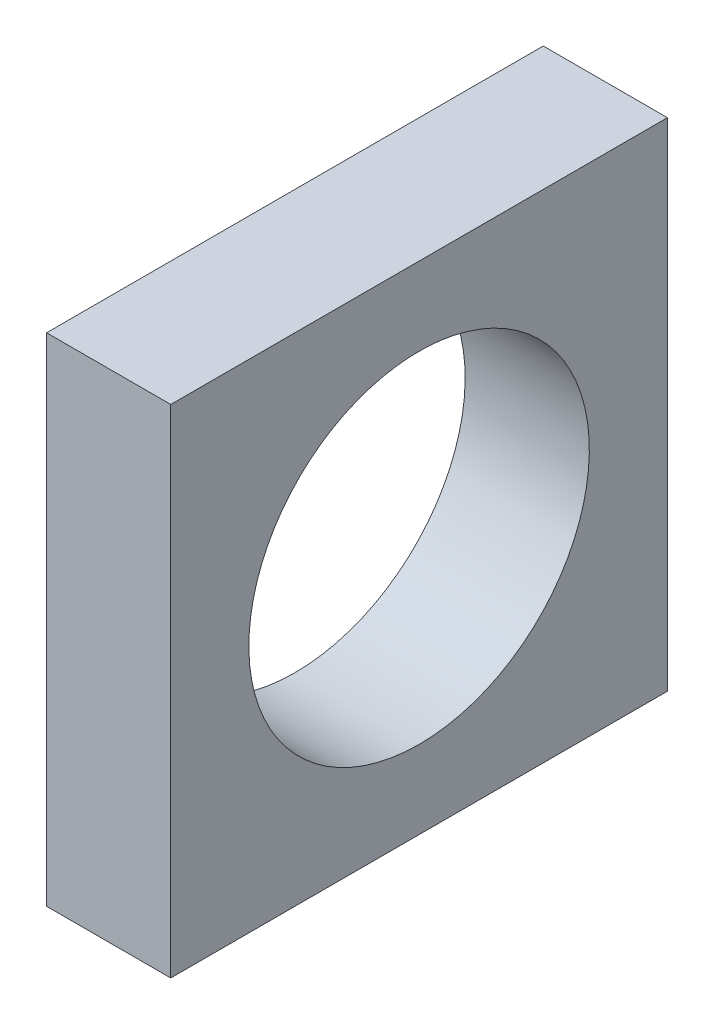
ISO-10303-21;
HEADER;
FILE_DESCRIPTION(('STEP AP214'),'2;1');
FILE_NAME('part.step','',(''),(''),'','','');
FILE_SCHEMA(('AUTOMOTIVE_DESIGN { 1 0 10303 214 1 1 1 1 }'));
ENDSEC;
DATA;
#1=APPLICATION_CONTEXT('core data for automotive mechanical design processes');
#2=APPLICATION_PROTOCOL_DEFINITION('international standard','automotive_design',2000,#1);
#3=PRODUCT_CONTEXT('',#1,'mechanical');
#4=PRODUCT('Part','Part','',(#3));
#5=PRODUCT_RELATED_PRODUCT_CATEGORY('part','',(#4));
#6=PRODUCT_DEFINITION_FORMATION('','',#4);
#7=PRODUCT_DEFINITION_CONTEXT('part definition',#1,'design');
#8=PRODUCT_DEFINITION('design','',#6,#7);
#9=PRODUCT_DEFINITION_SHAPE('','',#8);
#10=(LENGTH_UNIT() NAMED_UNIT(*) SI_UNIT(.MILLI.,.METRE.));
#11=(NAMED_UNIT(*) PLANE_ANGLE_UNIT() SI_UNIT($,.RADIAN.));
#12=(NAMED_UNIT(*) SI_UNIT($,.STERADIAN.) SOLID_ANGLE_UNIT());
#13=UNCERTAINTY_MEASURE_WITH_UNIT(LENGTH_MEASURE(1.E-05),#10,'distance_accuracy_value','');
#14=(GEOMETRIC_REPRESENTATION_CONTEXT(3) GLOBAL_UNCERTAINTY_ASSIGNED_CONTEXT((#13)) GLOBAL_UNIT_ASSIGNED_CONTEXT((#10,
#11,#12)) REPRESENTATION_CONTEXT('',''));
#15=CARTESIAN_POINT('',(0.,0.,0.));
#16=DIRECTION('',(0.,0.,1.));
#17=DIRECTION('',(1.,0.,0.));
#18=AXIS2_PLACEMENT_3D('',#15,#16,#17);
#19=CARTESIAN_POINT('',(5.14767421570164,-28.7493896494891,25.4));
#20=DIRECTION('',(1.,0.,0.));
#21=DIRECTION('',(0.,0.,-1.));
#22=AXIS2_PLACEMENT_3D('',#19,#20,#21);
#23=PLANE('',#22);
#24=CARTESIAN_POINT('',(5.14767421570164,-16.0493896494891,12.7));
#25=DIRECTION('',(-1.,0.,0.));
#26=DIRECTION('',(0.,-1.,0.));
#27=AXIS2_PLACEMENT_3D('',#24,#25,#26);
#28=CIRCLE('',#27,8.70585);
#29=CARTESIAN_POINT('',(5.14767421570164,-24.7552396494891,12.7));
#30=VERTEX_POINT('',#29);
#31=EDGE_CURVE('E112',#30,#30,#28,.T.);
#32=ORIENTED_EDGE('',*,*,#31,.F.);
#33=EDGE_LOOP('',(#32));
#34=FACE_BOUND('',#33,.T.);
#35=DIRECTION('',(0.,-1.,0.));
#36=VECTOR('',#35,1.);
#37=CARTESIAN_POINT('',(5.14767421570164,-28.7493896494891,0.));
#38=LINE('',#37,#36);
#39=CARTESIAN_POINT('',(5.14767421570164,-3.34938964948908,0.));
#40=VERTEX_POINT('',#39);
#41=CARTESIAN_POINT('',(5.14767421570164,-28.7493896494891,0.));
#42=VERTEX_POINT('',#41);
#43=EDGE_CURVE('E96',#40,#42,#38,.T.);
#44=ORIENTED_EDGE('',*,*,#43,.T.);
#45=DIRECTION('',(0.,0.,-1.));
#46=VECTOR('',#45,1.);
#47=CARTESIAN_POINT('',(5.14767421570164,-28.7493896494891,25.4));
#48=LINE('',#47,#46);
#49=CARTESIAN_POINT('',(5.14767421570164,-28.7493896494891,25.4));
#50=VERTEX_POINT('',#49);
#51=EDGE_CURVE('E11',#50,#42,#48,.T.);
#52=ORIENTED_EDGE('',*,*,#51,.F.);
#53=DIRECTION('',(0.,-1.,0.));
#54=VECTOR('',#53,1.);
#55=CARTESIAN_POINT('',(5.14767421570164,-28.7493896494891,25.4));
#56=LINE('',#55,#54);
#57=CARTESIAN_POINT('',(5.14767421570164,-3.34938964948908,25.4));
#58=VERTEX_POINT('',#57);
#59=EDGE_CURVE('E84',#58,#50,#56,.T.);
#60=ORIENTED_EDGE('',*,*,#59,.F.);
#61=DIRECTION('',(0.,0.,-1.));
#62=VECTOR('',#61,1.);
#63=CARTESIAN_POINT('',(5.14767421570164,-3.34938964948908,25.4));
#64=LINE('',#63,#62);
#65=EDGE_CURVE('E92',#58,#40,#64,.T.);
#66=ORIENTED_EDGE('',*,*,#65,.T.);
#67=EDGE_LOOP('',(#44,#52,#60,#66));
#68=FACE_BOUND('',#67,.T.);
#69=ADVANCED_FACE('F33',(#34,#68),#23,.F.);
#70=CARTESIAN_POINT('',(5.14767421570164,-28.7493896494891,25.4));
#71=DIRECTION('',(0.,1.,0.));
#72=DIRECTION('',(0.,0.,1.));
#73=AXIS2_PLACEMENT_3D('',#70,#71,#72);
#74=PLANE('',#73);
#75=DIRECTION('',(1.,0.,0.));
#76=VECTOR('',#75,1.);
#77=CARTESIAN_POINT('',(5.14767421570164,-28.7493896494891,0.));
#78=LINE('',#77,#76);
#79=CARTESIAN_POINT('',(11.4976742157016,-28.7493896494891,0.));
#80=VERTEX_POINT('',#79);
#81=EDGE_CURVE('E88',#42,#80,#78,.T.);
#82=ORIENTED_EDGE('',*,*,#81,.T.);
#83=DIRECTION('',(0.,0.,-1.));
#84=VECTOR('',#83,1.);
#85=CARTESIAN_POINT('',(11.4976742157016,-28.7493896494891,25.4));
#86=LINE('',#85,#84);
#87=CARTESIAN_POINT('',(11.4976742157016,-28.7493896494891,25.4));
#88=VERTEX_POINT('',#87);
#89=EDGE_CURVE('E41',#88,#80,#86,.T.);
#90=ORIENTED_EDGE('',*,*,#89,.F.);
#91=DIRECTION('',(1.,0.,0.));
#92=VECTOR('',#91,1.);
#93=CARTESIAN_POINT('',(5.14767421570164,-28.7493896494891,25.4));
#94=LINE('',#93,#92);
#95=EDGE_CURVE('E79',#50,#88,#94,.T.);
#96=ORIENTED_EDGE('',*,*,#95,.F.);
#97=ORIENTED_EDGE('',*,*,#51,.T.);
#98=EDGE_LOOP('',(#82,#90,#96,#97));
#99=FACE_BOUND('',#98,.T.);
#100=ADVANCED_FACE('F87',(#99),#74,.F.);
#101=CARTESIAN_POINT('',(11.4976742157016,-28.7493896494891,25.4));
#102=DIRECTION('',(-1.,0.,0.));
#103=DIRECTION('',(0.,0.,1.));
#104=AXIS2_PLACEMENT_3D('',#101,#102,#103);
#105=PLANE('',#104);
#106=CARTESIAN_POINT('',(11.4976742157017,-16.0493896494891,12.7));
#107=DIRECTION('',(-1.,0.,0.));
#108=DIRECTION('',(0.,-1.,0.));
#109=AXIS2_PLACEMENT_3D('',#106,#107,#108);
#110=CIRCLE('',#109,8.70585);
#111=CARTESIAN_POINT('',(11.4976742157017,-24.7552396494891,12.7));
#112=VERTEX_POINT('',#111);
#113=EDGE_CURVE('E99',#112,#112,#110,.F.);
#114=ORIENTED_EDGE('',*,*,#113,.F.);
#115=EDGE_LOOP('',(#114));
#116=FACE_BOUND('',#115,.T.);
#117=DIRECTION('',(0.,1.,0.));
#118=VECTOR('',#117,1.);
#119=CARTESIAN_POINT('',(11.4976742157016,-28.7493896494891,0.));
#120=LINE('',#119,#118);
#121=CARTESIAN_POINT('',(11.4976742157016,-3.34938964948908,0.));
#122=VERTEX_POINT('',#121);
#123=EDGE_CURVE('E66',#80,#122,#120,.T.);
#124=ORIENTED_EDGE('',*,*,#123,.T.);
#125=DIRECTION('',(0.,0.,-1.));
#126=VECTOR('',#125,1.);
#127=CARTESIAN_POINT('',(11.4976742157016,-3.34938964948908,25.4));
#128=LINE('',#127,#126);
#129=CARTESIAN_POINT('',(11.4976742157016,-3.34938964948908,25.4));
#130=VERTEX_POINT('',#129);
#131=EDGE_CURVE('E89',#130,#122,#128,.T.);
#132=ORIENTED_EDGE('',*,*,#131,.F.);
#133=DIRECTION('',(0.,1.,0.));
#134=VECTOR('',#133,1.);
#135=CARTESIAN_POINT('',(11.4976742157016,-28.7493896494891,25.4));
#136=LINE('',#135,#134);
#137=EDGE_CURVE('E82',#88,#130,#136,.T.);
#138=ORIENTED_EDGE('',*,*,#137,.F.);
#139=ORIENTED_EDGE('',*,*,#89,.T.);
#140=EDGE_LOOP('',(#124,#132,#138,#139));
#141=FACE_BOUND('',#140,.T.);
#142=ADVANCED_FACE('F90',(#116,#141),#105,.F.);
#143=CARTESIAN_POINT('',(5.14767421570164,-3.34938964948908,25.4));
#144=DIRECTION('',(0.,-1.,0.));
#145=DIRECTION('',(0.,0.,-1.));
#146=AXIS2_PLACEMENT_3D('',#143,#144,#145);
#147=PLANE('',#146);
#148=DIRECTION('',(-1.,0.,0.));
#149=VECTOR('',#148,1.);
#150=CARTESIAN_POINT('',(5.14767421570164,-3.34938964948908,0.));
#151=LINE('',#150,#149);
#152=EDGE_CURVE('E72',#122,#40,#151,.T.);
#153=ORIENTED_EDGE('',*,*,#152,.T.);
#154=ORIENTED_EDGE('',*,*,#65,.F.);
#155=DIRECTION('',(-1.,0.,0.));
#156=VECTOR('',#155,1.);
#157=CARTESIAN_POINT('',(5.14767421570164,-3.34938964948908,25.4));
#158=LINE('',#157,#156);
#159=EDGE_CURVE('E49',#130,#58,#158,.T.);
#160=ORIENTED_EDGE('',*,*,#159,.F.);
#161=ORIENTED_EDGE('',*,*,#131,.T.);
#162=EDGE_LOOP('',(#153,#154,#160,#161));
#163=FACE_BOUND('',#162,.T.);
#164=ADVANCED_FACE('F104',(#163),#147,.F.);
#165=CARTESIAN_POINT('',(0.,0.,25.4));
#166=DIRECTION('',(0.,0.,-1.));
#167=DIRECTION('',(-1.,0.,0.));
#168=AXIS2_PLACEMENT_3D('',#165,#166,#167);
#169=PLANE('',#168);
#170=ORIENTED_EDGE('',*,*,#59,.T.);
#171=ORIENTED_EDGE('',*,*,#95,.T.);
#172=ORIENTED_EDGE('',*,*,#137,.T.);
#173=ORIENTED_EDGE('',*,*,#159,.T.);
#174=EDGE_LOOP('',(#170,#171,#172,#173));
#175=FACE_BOUND('',#174,.T.);
#176=ADVANCED_FACE('F80',(#175),#169,.F.);
#177=CARTESIAN_POINT('',(0.,0.,0.));
#178=DIRECTION('',(0.,0.,-1.));
#179=DIRECTION('',(-1.,0.,0.));
#180=AXIS2_PLACEMENT_3D('',#177,#178,#179);
#181=PLANE('',#180);
#182=ORIENTED_EDGE('',*,*,#43,.F.);
#183=ORIENTED_EDGE('',*,*,#152,.F.);
#184=ORIENTED_EDGE('',*,*,#123,.F.);
#185=ORIENTED_EDGE('',*,*,#81,.F.);
#186=EDGE_LOOP('',(#182,#183,#184,#185));
#187=FACE_BOUND('',#186,.T.);
#188=ADVANCED_FACE('F107',(#187),#181,.T.);
#189=CARTESIAN_POINT('',(36.1215364996733,-16.0493896494891,12.7));
#190=DIRECTION('',(-1.,0.,0.));
#191=DIRECTION('',(0.,-1.,0.));
#192=AXIS2_PLACEMENT_3D('',#189,#190,#191);
#193=CYLINDRICAL_SURFACE('',#192,8.70585);
#194=ORIENTED_EDGE('',*,*,#113,.T.);
#195=EDGE_LOOP('',(#194));
#196=FACE_BOUND('',#195,.T.);
#197=ORIENTED_EDGE('',*,*,#31,.T.);
#198=EDGE_LOOP('',(#197));
#199=FACE_BOUND('',#198,.T.);
#200=ADVANCED_FACE('F116',(#196,#199),#193,.F.);
#201=CLOSED_SHELL('',(#69,#100,#142,#164,#176,#188,#200));
#202=MANIFOLD_SOLID_BREP('B2',#201);
#203=ADVANCED_BREP_SHAPE_REPRESENTATION('',(#18,#202),#14);
#204=SHAPE_DEFINITION_REPRESENTATION(#9,#203);
ENDSEC;
END-ISO-10303-21;
